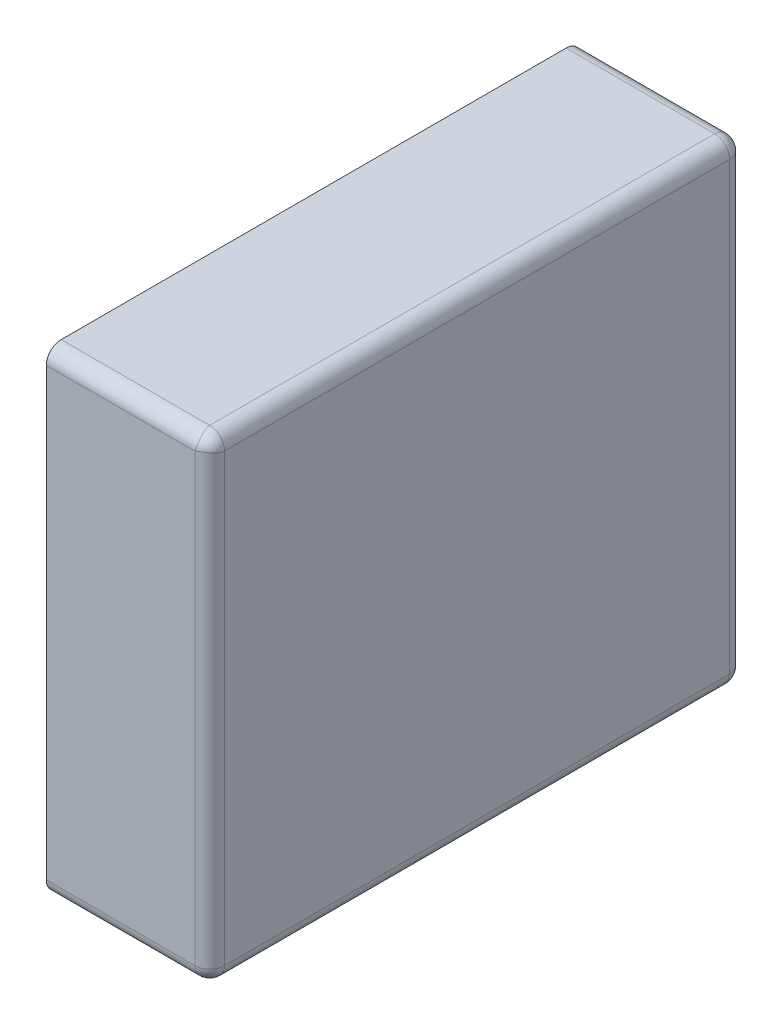
ISO-10303-21;
HEADER;
FILE_DESCRIPTION(('STEP AP214'),'2;1');
FILE_NAME('part.step','',(''),(''),'','','');
FILE_SCHEMA(('AUTOMOTIVE_DESIGN { 1 0 10303 214 1 1 1 1 }'));
ENDSEC;
DATA;
#1=APPLICATION_CONTEXT('core data for automotive mechanical design processes');
#2=APPLICATION_PROTOCOL_DEFINITION('international standard','automotive_design',2000,#1);
#3=PRODUCT_CONTEXT('',#1,'mechanical');
#4=PRODUCT('Part','Part','',(#3));
#5=PRODUCT_RELATED_PRODUCT_CATEGORY('part','',(#4));
#6=PRODUCT_DEFINITION_FORMATION('','',#4);
#7=PRODUCT_DEFINITION_CONTEXT('part definition',#1,'design');
#8=PRODUCT_DEFINITION('design','',#6,#7);
#9=PRODUCT_DEFINITION_SHAPE('','',#8);
#10=(LENGTH_UNIT() NAMED_UNIT(*) SI_UNIT(.MILLI.,.METRE.));
#11=(NAMED_UNIT(*) PLANE_ANGLE_UNIT() SI_UNIT($,.RADIAN.));
#12=(NAMED_UNIT(*) SI_UNIT($,.STERADIAN.) SOLID_ANGLE_UNIT());
#13=UNCERTAINTY_MEASURE_WITH_UNIT(LENGTH_MEASURE(1.E-05),#10,'distance_accuracy_value','');
#14=(GEOMETRIC_REPRESENTATION_CONTEXT(3) GLOBAL_UNCERTAINTY_ASSIGNED_CONTEXT((#13)) GLOBAL_UNIT_ASSIGNED_CONTEXT((#10,
#11,#12)) REPRESENTATION_CONTEXT('',''));
#15=CARTESIAN_POINT('',(0.,0.,0.));
#16=DIRECTION('',(0.,0.,1.));
#17=DIRECTION('',(1.,0.,0.));
#18=AXIS2_PLACEMENT_3D('',#15,#16,#17);
#19=CARTESIAN_POINT('',(0.25,-0.658333310554192,0.05));
#20=DIRECTION('',(-0.816496580927726,-0.408248290463864,-0.408248290463863));
#21=DIRECTION('',(0.577350269189626,-0.577350269189627,-0.577350269189625));
#22=AXIS2_PLACEMENT_3D('',#19,#20,#21);
#23=SPHERICAL_SURFACE('',#22,0.05);
#24=CARTESIAN_POINT('',(0.25,-0.658333310554192,0.05));
#25=DIRECTION('',(1.,0.,0.));
#26=DIRECTION('',(0.,0.,-1.));
#27=AXIS2_PLACEMENT_3D('',#24,#25,#26);
#28=CIRCLE('',#27,0.05);
#29=CARTESIAN_POINT('',(0.25,-0.708333310554192,0.05));
#30=VERTEX_POINT('',#29);
#31=CARTESIAN_POINT('',(0.25,-0.658333310554192,0.));
#32=VERTEX_POINT('',#31);
#33=EDGE_CURVE('E11',#30,#32,#28,.T.);
#34=ORIENTED_EDGE('',*,*,#33,.T.);
#35=CARTESIAN_POINT('',(0.25,-0.658333310554192,0.05));
#36=DIRECTION('',(0.,-1.,0.));
#37=DIRECTION('',(1.,0.,0.));
#38=AXIS2_PLACEMENT_3D('',#35,#36,#37);
#39=CIRCLE('',#38,0.05);
#40=CARTESIAN_POINT('',(0.3,-0.658333310554192,0.05));
#41=VERTEX_POINT('',#40);
#42=EDGE_CURVE('E24',#32,#41,#39,.T.);
#43=ORIENTED_EDGE('',*,*,#42,.T.);
#44=CARTESIAN_POINT('',(0.25,-0.658333310554192,0.05));
#45=DIRECTION('',(0.,0.,-1.));
#46=DIRECTION('',(0.,-1.,0.));
#47=AXIS2_PLACEMENT_3D('',#44,#45,#46);
#48=CIRCLE('',#47,0.05);
#49=EDGE_CURVE('E315',#41,#30,#48,.T.);
#50=ORIENTED_EDGE('',*,*,#49,.T.);
#51=EDGE_LOOP('',(#34,#43,#50));
#52=FACE_BOUND('',#51,.T.);
#53=ADVANCED_FACE('F17',(#52),#23,.T.);
#54=CARTESIAN_POINT('',(0.25,-0.658333310554192,1.75));
#55=DIRECTION('',(-0.408248290463863,-0.816496580927725,-0.408248290463864));
#56=DIRECTION('',(0.577350269189625,-0.577350269189627,0.577350269189626));
#57=AXIS2_PLACEMENT_3D('',#54,#55,#56);
#58=SPHERICAL_SURFACE('',#57,0.05);
#59=CARTESIAN_POINT('',(0.25,-0.658333310554192,1.8));
#60=CARTESIAN_POINT('',(0.250056476640882,-0.659164662981859,1.80000002031397));
#61=CARTESIAN_POINT('',(0.250121168311557,-0.65999542167902,1.79997917131755));
#62=CARTESIAN_POINT('',(0.250265391195623,-0.661657334802944,1.79989569556504));
#63=CARTESIAN_POINT('',(0.250344988001439,-0.66248847412573,1.79983288086806));
#64=CARTESIAN_POINT('',(0.250517234671643,-0.664148546660269,1.79966509757926));
#65=CARTESIAN_POINT('',(0.250609936033336,-0.664977457349145,1.79955995950256));
#66=CARTESIAN_POINT('',(0.250806520816706,-0.666630527199555,1.79930737239836));
#67=CARTESIAN_POINT('',(0.25091044290025,-0.667454658911413,1.79915977396341));
#68=CARTESIAN_POINT('',(0.251127528752862,-0.669095657803344,1.79882229239235));
#69=CARTESIAN_POINT('',(0.251240719867609,-0.669912494981016,1.79863228105857));
#70=CARTESIAN_POINT('',(0.251474344176626,-0.671536442570935,1.79821019528102));
#71=CARTESIAN_POINT('',(0.251594795122853,-0.672343522825329,1.79797801468437));
#72=CARTESIAN_POINT('',(0.251840892195576,-0.673945551721639,1.79747200526275));
#73=CARTESIAN_POINT('',(0.251966548375925,-0.674740472397371,1.79719809281404));
#74=CARTESIAN_POINT('',(0.252220973549075,-0.67631584408808,1.79660922840147));
#75=CARTESIAN_POINT('',(0.252349746928956,-0.677096271606362,1.79629421548598));
#76=CARTESIAN_POINT('',(0.252608300810853,-0.678640393971993,1.79562395131688));
#77=CARTESIAN_POINT('',(0.252738082163722,-0.679404071972065,1.79526866158421));
#78=CARTESIAN_POINT('',(0.252996535248399,-0.680912515415975,1.79451883535746));
#79=CARTESIAN_POINT('',(0.253125206487437,-0.681657272720296,1.79412428231988));
#80=CARTESIAN_POINT('',(0.253379323912972,-0.683125785626233,1.79329710837936));
#81=CARTESIAN_POINT('',(0.253504770480528,-0.683849543710642,1.79286449200134));
#82=CARTESIAN_POINT('',(0.253750336828149,-0.685274066953656,1.79196255359726));
#83=CARTESIAN_POINT('',(0.253870460068205,-0.685974846967864,1.79149325597784));
#84=CARTESIAN_POINT('',(0.254103304064891,-0.687351527474695,1.79051949570568));
#85=CARTESIAN_POINT('',(0.254216033516177,-0.688027456763577,1.79001507584848));
#86=CARTESIAN_POINT('',(0.254432052512975,-0.68935266005221,1.78897278428959));
#87=CARTESIAN_POINT('',(0.254535358057478,-0.690001978156978,1.78843497199004));
#88=CARTESIAN_POINT('',(0.254730542154479,-0.691272299809228,1.78732777460933));
#89=CARTESIAN_POINT('',(0.254822445957708,-0.691893363923171,1.78675846348493));
#90=CARTESIAN_POINT('',(0.254992901649071,-0.693105639944394,1.78559030584348));
#91=CARTESIAN_POINT('',(0.255071489829275,-0.693696929802492,1.78499154553938));
#92=CARTESIAN_POINT('',(0.255213463043959,-0.694848245829343,1.78376667689025));
#93=CARTESIAN_POINT('',(0.255276897009026,-0.695408368013381,1.78314066449634));
#94=CARTESIAN_POINT('',(0.255386795425953,-0.696496067335968,1.78186361983902));
#95=CARTESIAN_POINT('',(0.255433322818258,-0.697023758979868,1.78121269055809));
#96=CARTESIAN_POINT('',(0.255507737338678,-0.698045449350346,1.77988827123633));
#97=CARTESIAN_POINT('',(0.25553570253075,-0.698539581233155,1.77921488834858));
#98=CARTESIAN_POINT('',(0.255571427793508,-0.699493140439531,1.77784814127885));
#99=CARTESIAN_POINT('',(0.255579281877824,-0.699952719457549,1.77715488544524));
#100=CARTESIAN_POINT('',(0.255573335713261,-0.700836299644668,1.77575108108726));
#101=CARTESIAN_POINT('',(0.255559645939104,-0.701260470653455,1.77504063906048));
#102=CARTESIAN_POINT('',(0.255509287643763,-0.702072501389798,1.77360524818424));
#103=CARTESIAN_POINT('',(0.255472746231199,-0.702460548424196,1.77288040091383));
#104=CARTESIAN_POINT('',(0.255375493621831,-0.703199738480209,1.77141907045753));
#105=CARTESIAN_POINT('',(0.255314925981526,-0.70355108531067,1.77068268089524));
#106=CARTESIAN_POINT('',(0.255168570932992,-0.704216423264989,1.76920120834795));
#107=CARTESIAN_POINT('',(0.255082942970717,-0.704530633447628,1.76845620808787));
#108=CARTESIAN_POINT('',(0.254885566112575,-0.705121386709123,1.76696051703845));
#109=CARTESIAN_POINT('',(0.254773991607376,-0.705398162565069,1.76620989527186));
#110=CARTESIAN_POINT('',(0.254523973299393,-0.705913876381134,1.76470600292695));
#111=CARTESIAN_POINT('',(0.254385717519098,-0.706153059023342,1.7639527851382));
#112=CARTESIAN_POINT('',(0.254081755398417,-0.706593549745939,1.76244679638543));
#113=CARTESIAN_POINT('',(0.253916248962334,-0.706795112374401,1.76169405953744));
#114=CARTESIAN_POINT('',(0.253557343726359,-0.707160476248509,1.76019206042752));
#115=CARTESIAN_POINT('',(0.253364154831346,-0.707324539502695,1.75944281229227));
#116=CARTESIAN_POINT('',(0.253052732369609,-0.707542869289562,1.7583219455075));
#117=CARTESIAN_POINT('',(0.252945638881777,-0.707610870709135,1.75794983260432));
#118=CARTESIAN_POINT('',(0.252724431166697,-0.707737569445092,1.75720763742837));
#119=CARTESIAN_POINT('',(0.252610344441124,-0.707796300321971,1.75683755274195));
#120=CARTESIAN_POINT('',(0.252375149481327,-0.70790450391496,1.75609981269566));
#121=CARTESIAN_POINT('',(0.252254068989278,-0.707954010307306,1.75573215342186));
#122=CARTESIAN_POINT('',(0.252004892004011,-0.708043823540288,1.75499964182244));
#123=CARTESIAN_POINT('',(0.251876823418455,-0.708084164066007,1.75463478414168));
#124=CARTESIAN_POINT('',(0.25161368768569,-0.708155710450416,1.7539082563057));
#125=CARTESIAN_POINT('',(0.251478648512781,-0.708186949917715,1.75354657933213));
#126=CARTESIAN_POINT('',(0.251201599789781,-0.708240367053443,1.75282678964261));
#127=CARTESIAN_POINT('',(0.251059618183824,-0.708262578160602,1.75246866865684));
#128=CARTESIAN_POINT('',(0.250768722771826,-0.708298018075102,1.75175636445159));
#129=CARTESIAN_POINT('',(0.250619836783965,-0.70831128006162,1.75140217152902));
#130=CARTESIAN_POINT('',(0.250315184973883,-0.70832891062971,1.75069809533217));
#131=CARTESIAN_POINT('',(0.25015944673132,-0.708333312030094,1.75034820094293));
#132=CARTESIAN_POINT('',(0.25,-0.708333310554192,1.75));
#133=B_SPLINE_CURVE_WITH_KNOTS('',3,(#59,#60,#61,#62,#63,#64,#65,#66,#67,#68,#69,#70,#71,#72,
#73,#74,#75,#76,#77,#78,#79,#80,#81,#82,#83,#84,#85,#86,#87,#88,#89,#90,#91,#92,#93,#94,#95,#96,
#97,#98,#99,#100,#101,#102,#103,#104,#105,#106,#107,#108,#109,#110,#111,#112,#113,#114,#115,
#116,#117,#118,#119,#120,#121,#122,#123,#124,#125,#126,#127,#128,#129,#130,#131,#132),
.UNSPECIFIED.,.F.,.F.,(4,2,2,2,2,2,2,2,2,2,2,2,2,2,2,2,2,2,2,2,2,2,2,2,2,2,2,2,2,2,2,2,2,2,2,2,
4),(0.,0.00249945349828864,0.00501017636236172,0.00753105510997415,0.0100609150362242,
0.0125985278601288,0.0151426194708621,0.017691877752768,0.020244960471291,0.0228005032044077,
0.0253571273060391,0.0279134478892868,0.030468081818201,0.0330196556971654,0.0355668138468769,
0.0381082262553105,0.0406425964909795,0.0431686695642027,0.0456852397199664,0.048191158143267,
0.0506853405545279,0.0531667746687544,0.0556345274875088,0.0580877523875283,0.0605256959638786,
0.0629477045789642,0.0653532305615734,0.0677418379925142,0.0701132080055176,0.0712924926926686,
0.0724674051483095,0.0736379404537152,0.0748041017706803,0.0759659004268235,0.077123355986903,
0.0782764963093342,0.0794253575870824),.UNSPECIFIED.);
#134=CARTESIAN_POINT('',(0.25,-0.658333310554192,1.8));
#135=VERTEX_POINT('',#134);
#136=CARTESIAN_POINT('',(0.25,-0.708333310554192,1.75));
#137=VERTEX_POINT('',#136);
#138=EDGE_CURVE('E267',#135,#137,#133,.T.);
#139=ORIENTED_EDGE('',*,*,#138,.T.);
#140=CARTESIAN_POINT('',(0.25,-0.658333310554192,1.75));
#141=DIRECTION('',(0.,0.,1.));
#142=DIRECTION('',(1.,0.,0.));
#143=AXIS2_PLACEMENT_3D('',#140,#141,#142);
#144=CIRCLE('',#143,0.05);
#145=CARTESIAN_POINT('',(0.3,-0.658333310554192,1.75));
#146=VERTEX_POINT('',#145);
#147=EDGE_CURVE('E263',#137,#146,#144,.T.);
#148=ORIENTED_EDGE('',*,*,#147,.T.);
#149=CARTESIAN_POINT('',(0.25,-0.658333310554192,1.75));
#150=DIRECTION('',(0.,-1.,0.));
#151=DIRECTION('',(0.,0.,1.));
#152=AXIS2_PLACEMENT_3D('',#149,#150,#151);
#153=CIRCLE('',#152,0.05);
#154=EDGE_CURVE('E258',#146,#135,#153,.T.);
#155=ORIENTED_EDGE('',*,*,#154,.T.);
#156=EDGE_LOOP('',(#139,#148,#155));
#157=FACE_BOUND('',#156,.T.);
#158=ADVANCED_FACE('F292',(#157),#58,.T.);
#159=CARTESIAN_POINT('',(0.25,-0.658333310554192,0.));
#160=DIRECTION('',(0.,0.,1.));
#161=DIRECTION('',(0.707106781186548,-0.707106781186548,0.));
#162=AXIS2_PLACEMENT_3D('',#159,#160,#161);
#163=CYLINDRICAL_SURFACE('',#162,0.05);
#164=ORIENTED_EDGE('',*,*,#147,.F.);
#165=DIRECTION('',(0.,0.,-1.));
#166=VECTOR('',#165,1.);
#167=CARTESIAN_POINT('',(0.25,-0.708333310554192,0.));
#168=LINE('',#167,#166);
#169=EDGE_CURVE('E253',#137,#30,#168,.T.);
#170=ORIENTED_EDGE('',*,*,#169,.T.);
#171=ORIENTED_EDGE('',*,*,#49,.F.);
#172=DIRECTION('',(0.,0.,1.));
#173=VECTOR('',#172,1.);
#174=CARTESIAN_POINT('',(0.3,-0.658333310554192,0.));
#175=LINE('',#174,#173);
#176=EDGE_CURVE('E250',#41,#146,#175,.T.);
#177=ORIENTED_EDGE('',*,*,#176,.T.);
#178=EDGE_LOOP('',(#164,#170,#171,#177));
#179=FACE_BOUND('',#178,.T.);
#180=ADVANCED_FACE('F296',(#179),#163,.T.);
#181=CARTESIAN_POINT('',(0.25,0.841666689445808,0.05));
#182=DIRECTION('',(-0.408248290463862,-0.408248290463864,-0.816496580927726));
#183=DIRECTION('',(0.577350269189626,0.577350269189626,-0.577350269189626));
#184=AXIS2_PLACEMENT_3D('',#181,#182,#183);
#185=SPHERICAL_SURFACE('',#184,0.05);
#186=CARTESIAN_POINT('',(0.25,0.841666689445808,0.05));
#187=DIRECTION('',(0.,1.,0.));
#188=DIRECTION('',(0.,0.,-1.));
#189=AXIS2_PLACEMENT_3D('',#186,#187,#188);
#190=CIRCLE('',#189,0.05);
#191=CARTESIAN_POINT('',(0.3,0.841666689445808,0.05));
#192=VERTEX_POINT('',#191);
#193=CARTESIAN_POINT('',(0.25,0.841666689445808,0.));
#194=VERTEX_POINT('',#193);
#195=EDGE_CURVE('E248',#192,#194,#190,.T.);
#196=ORIENTED_EDGE('',*,*,#195,.T.);
#197=CARTESIAN_POINT('',(0.25,0.841666689445808,0.05));
#198=DIRECTION('',(1.,0.,0.));
#199=DIRECTION('',(0.,1.,0.));
#200=AXIS2_PLACEMENT_3D('',#197,#198,#199);
#201=CIRCLE('',#200,0.05);
#202=CARTESIAN_POINT('',(0.25,0.891666689445808,0.05));
#203=VERTEX_POINT('',#202);
#204=EDGE_CURVE('E246',#194,#203,#201,.T.);
#205=ORIENTED_EDGE('',*,*,#204,.T.);
#206=CARTESIAN_POINT('',(0.25,0.841666689445808,0.05));
#207=DIRECTION('',(0.,0.,-1.));
#208=DIRECTION('',(1.,0.,0.));
#209=AXIS2_PLACEMENT_3D('',#206,#207,#208);
#210=CIRCLE('',#209,0.05);
#211=EDGE_CURVE('E243',#203,#192,#210,.T.);
#212=ORIENTED_EDGE('',*,*,#211,.T.);
#213=EDGE_LOOP('',(#196,#205,#212));
#214=FACE_BOUND('',#213,.T.);
#215=ADVANCED_FACE('F301',(#214),#185,.T.);
#216=CARTESIAN_POINT('',(0.1625,0.841666689445808,0.05));
#217=DIRECTION('',(1.,0.,0.));
#218=DIRECTION('',(0.,0.707106781186548,-0.707106781186547));
#219=AXIS2_PLACEMENT_3D('',#216,#217,#218);
#220=CYLINDRICAL_SURFACE('',#219,0.05);
#221=CARTESIAN_POINT('',(-0.25,0.841666689445808,0.05));
#222=DIRECTION('',(1.,0.,0.));
#223=DIRECTION('',(0.,0.707106781186548,-0.707106781186547));
#224=AXIS2_PLACEMENT_3D('',#221,#222,#223);
#225=CIRCLE('',#224,0.05);
#226=CARTESIAN_POINT('',(-0.25,0.841666689445808,0.));
#227=VERTEX_POINT('',#226);
#228=CARTESIAN_POINT('',(-0.25,0.891666689445808,0.05));
#229=VERTEX_POINT('',#228);
#230=EDGE_CURVE('E239',#227,#229,#225,.T.);
#231=ORIENTED_EDGE('',*,*,#230,.T.);
#232=DIRECTION('',(1.,0.,0.));
#233=VECTOR('',#232,1.);
#234=CARTESIAN_POINT('',(0.1625,0.891666689445808,0.05));
#235=LINE('',#234,#233);
#236=EDGE_CURVE('E233',#229,#203,#235,.T.);
#237=ORIENTED_EDGE('',*,*,#236,.T.);
#238=ORIENTED_EDGE('',*,*,#204,.F.);
#239=DIRECTION('',(-1.,0.,0.));
#240=VECTOR('',#239,1.);
#241=CARTESIAN_POINT('',(0.1625,0.841666689445808,0.));
#242=LINE('',#241,#240);
#243=EDGE_CURVE('E231',#194,#227,#242,.T.);
#244=ORIENTED_EDGE('',*,*,#243,.T.);
#245=EDGE_LOOP('',(#231,#237,#238,#244));
#246=FACE_BOUND('',#245,.T.);
#247=ADVANCED_FACE('F194',(#246),#220,.T.);
#248=CARTESIAN_POINT('',(0.25,0.841666689445808,1.75));
#249=DIRECTION('',(0.408248290463863,0.408248290463863,-0.816496580927726));
#250=DIRECTION('',(0.577350269189625,0.577350269189626,0.577350269189626));
#251=AXIS2_PLACEMENT_3D('',#248,#249,#250);
#252=SPHERICAL_SURFACE('',#251,0.05);
#253=CARTESIAN_POINT('',(0.25,0.841666689445808,1.8));
#254=CARTESIAN_POINT('',(0.250348200942932,0.841826136177128,1.8000000014759));
#255=CARTESIAN_POINT('',(0.250698095332166,0.841981874419691,1.79999560007552));
#256=CARTESIAN_POINT('',(0.251402171529021,0.842286526229773,1.79997796950743));
#257=CARTESIAN_POINT('',(0.251756364451594,0.842435412217634,1.79996470752091));
#258=CARTESIAN_POINT('',(0.252468668656838,0.842726307629632,1.79992926760641));
#259=CARTESIAN_POINT('',(0.25282678964261,0.842868289235589,1.79990705649925));
#260=CARTESIAN_POINT('',(0.253546579332125,0.843145337958589,1.79985363936352));
#261=CARTESIAN_POINT('',(0.253908256305697,0.843280377131498,1.79982239989622));
#262=CARTESIAN_POINT('',(0.254634784141684,0.843543512864263,1.79975085351182));
#263=CARTESIAN_POINT('',(0.254999641822439,0.843671581449819,1.7997105129861));
#264=CARTESIAN_POINT('',(0.255732153421865,0.843920758435086,1.79962069975311));
#265=CARTESIAN_POINT('',(0.256099812695661,0.844041838927135,1.79957119336077));
#266=CARTESIAN_POINT('',(0.256837552741953,0.844277033886932,1.79946298976778));
#267=CARTESIAN_POINT('',(0.257207637428366,0.844391120612505,1.7994042588909));
#268=CARTESIAN_POINT('',(0.257949832604319,0.844612328327585,1.79927756015494));
#269=CARTESIAN_POINT('',(0.258321945507501,0.844719421815417,1.79920955873537));
#270=CARTESIAN_POINT('',(0.259442812292273,0.845030844277154,1.7989912289485));
#271=CARTESIAN_POINT('',(0.260192060427522,0.845224033172167,1.79882716569432));
#272=CARTESIAN_POINT('',(0.261694059537444,0.845582938408142,1.79846180182021));
#273=CARTESIAN_POINT('',(0.262446796385434,0.845748444844225,1.79826023919175));
#274=CARTESIAN_POINT('',(0.263952785138195,0.846052406964906,1.79781974846915));
#275=CARTESIAN_POINT('',(0.264706002926951,0.846190662745201,1.79758056582694));
#276=CARTESIAN_POINT('',(0.266209895271862,0.846440681053184,1.79706485201088));
#277=CARTESIAN_POINT('',(0.266960517038454,0.846552255558383,1.79678807615493));
#278=CARTESIAN_POINT('',(0.268456208087868,0.846749632416525,1.79619732289344));
#279=CARTESIAN_POINT('',(0.269201208347948,0.8468352603788,1.7958831127108));
#280=CARTESIAN_POINT('',(0.270682680895238,0.846981615427333,1.79521777475648));
#281=CARTESIAN_POINT('',(0.271419070457526,0.847042183067639,1.79486642792602));
#282=CARTESIAN_POINT('',(0.272880400913832,0.847139435677007,1.79412723787));
#283=CARTESIAN_POINT('',(0.273605248184243,0.847175977089571,1.79373919083561));
#284=CARTESIAN_POINT('',(0.275040639060477,0.847226335384912,1.79292716009926));
#285=CARTESIAN_POINT('',(0.275751081087255,0.847240025159069,1.79250298909048));
#286=CARTESIAN_POINT('',(0.277154885445235,0.847245971323632,1.79161940890336));
#287=CARTESIAN_POINT('',(0.277848141278855,0.847238117239316,1.79115982988534));
#288=CARTESIAN_POINT('',(0.279214888348585,0.847202391976558,1.79020627067896));
#289=CARTESIAN_POINT('',(0.279888271236327,0.847174426784487,1.78971213879615));
#290=CARTESIAN_POINT('',(0.281212690558093,0.847100012264066,1.78869044842568));
#291=CARTESIAN_POINT('',(0.281863619839021,0.847053484871761,1.78816275678178));
#292=CARTESIAN_POINT('',(0.283140664496341,0.846943586454834,1.78707505745919));
#293=CARTESIAN_POINT('',(0.283766676890247,0.846880152489767,1.78651493527515));
#294=CARTESIAN_POINT('',(0.28499154553938,0.846738179275083,1.7853636192483));
#295=CARTESIAN_POINT('',(0.285590305843476,0.846659591094879,1.7847723293902));
#296=CARTESIAN_POINT('',(0.286758463484926,0.846489135403516,1.78356005336898));
#297=CARTESIAN_POINT('',(0.287327774609329,0.846397231600287,1.78293898925504));
#298=CARTESIAN_POINT('',(0.288434971990044,0.846202047503286,1.78166866760279));
#299=CARTESIAN_POINT('',(0.288972784289588,0.846098741958783,1.78101934949802));
#300=CARTESIAN_POINT('',(0.290015075848481,0.845882722961985,1.77969414620939));
#301=CARTESIAN_POINT('',(0.290519495705679,0.845769993510699,1.7790182169205));
#302=CARTESIAN_POINT('',(0.291493255977843,0.845537149514013,1.77764153641367));
#303=CARTESIAN_POINT('',(0.291962553597264,0.845417026273957,1.77694075639946));
#304=CARTESIAN_POINT('',(0.292864492001337,0.845171459926336,1.77551623315645));
#305=CARTESIAN_POINT('',(0.293297108379355,0.84504601335878,1.77479247507204));
#306=CARTESIAN_POINT('',(0.294124282319878,0.844791895933245,1.7733239621661));
#307=CARTESIAN_POINT('',(0.294518835357465,0.844663224694207,1.77257920486178));
#308=CARTESIAN_POINT('',(0.295268661584212,0.84440477160953,1.77107076141787));
#309=CARTESIAN_POINT('',(0.29562395131688,0.844274990256661,1.7703070834178));
#310=CARTESIAN_POINT('',(0.29629421548598,0.844016436374764,1.76876296105217));
#311=CARTESIAN_POINT('',(0.296609228401466,0.843887662994883,1.76798253353389));
#312=CARTESIAN_POINT('',(0.297198092814036,0.843633237821733,1.76640716184318));
#313=CARTESIAN_POINT('',(0.297472005262752,0.843507581641384,1.76561224116745));
#314=CARTESIAN_POINT('',(0.297978014684369,0.843261484568661,1.76401021227114));
#315=CARTESIAN_POINT('',(0.298210195281024,0.843141033622434,1.76320313201674));
#316=CARTESIAN_POINT('',(0.298632281058567,0.842907409313417,1.76157918442682));
#317=CARTESIAN_POINT('',(0.298822292392348,0.84279421819867,1.76076234724915));
#318=CARTESIAN_POINT('',(0.299159773963409,0.842577132346058,1.75912134835722));
#319=CARTESIAN_POINT('',(0.299307372398355,0.842473210262514,1.75829721664536));
#320=CARTESIAN_POINT('',(0.299559959502557,0.842276625479144,1.75664414679495));
#321=CARTESIAN_POINT('',(0.299665097579262,0.842183924117451,1.75581523610608));
#322=CARTESIAN_POINT('',(0.299832880868058,0.842011677447247,1.75415516357154));
#323=CARTESIAN_POINT('',(0.299895695565037,0.841932080641431,1.75332402424875));
#324=CARTESIAN_POINT('',(0.299979171317549,0.841787857757365,1.75166211112483));
#325=CARTESIAN_POINT('',(0.300000020313967,0.84172316608669,1.75083135242767));
#326=CARTESIAN_POINT('',(0.3,0.841666689445808,1.75));
#327=B_SPLINE_CURVE_WITH_KNOTS('',3,(#253,#254,#255,#256,#257,#258,#259,#260,#261,#262,#263,
#264,#265,#266,#267,#268,#269,#270,#271,#272,#273,#274,#275,#276,#277,#278,#279,#280,#281,#282,
#283,#284,#285,#286,#287,#288,#289,#290,#291,#292,#293,#294,#295,#296,#297,#298,#299,#300,#301,
#302,#303,#304,#305,#306,#307,#308,#309,#310,#311,#312,#313,#314,#315,#316,#317,#318,#319,#320,
#321,#322,#323,#324,#325,#326),.UNSPECIFIED.,.F.,.F.,(4,2,2,2,2,2,2,2,2,2,2,2,2,2,2,2,2,2,2,2,2,
2,2,2,2,2,2,2,2,2,2,2,2,2,2,2,4),(0.,0.00114886127774815,0.00230200160017932,
0.00345945716025889,0.00462125581640195,0.00578741713336713,0.00695795243877275,
0.00813286489441384,0.00931214958156472,0.0116835195945681,0.014072127025509,0.0164776530081181,
0.0188996616232038,0.0213376051995539,0.0237908300995735,0.026258582918328,0.0287400170325544,
0.0312341994438154,0.033740117867116,0.0362566880228797,0.0387827610961028,0.0413171313317719,
0.0438585437402054,0.0464057018899169,0.0489572757688814,0.0515119096977955,0.0540682302810433,
0.0566248543826747,0.0591803971157913,0.0617334798343144,0.0642827381162203,0.0668268297269534,
0.0693644425508581,0.071894302477108,0.0744151812247205,0.0769259040887937,0.0794253575870821),.UNSPECIFIED.);
#328=CARTESIAN_POINT('',(0.25,0.841666689445808,1.8));
#329=VERTEX_POINT('',#328);
#330=CARTESIAN_POINT('',(0.3,0.841666689445808,1.75));
#331=VERTEX_POINT('',#330);
#332=EDGE_CURVE('E217',#329,#331,#327,.T.);
#333=ORIENTED_EDGE('',*,*,#332,.T.);
#334=CARTESIAN_POINT('',(0.25,0.841666689445808,1.75));
#335=DIRECTION('',(0.,0.,1.));
#336=DIRECTION('',(0.,1.,0.));
#337=AXIS2_PLACEMENT_3D('',#334,#335,#336);
#338=CIRCLE('',#337,0.05);
#339=CARTESIAN_POINT('',(0.25,0.891666689445808,1.75));
#340=VERTEX_POINT('',#339);
#341=EDGE_CURVE('E215',#331,#340,#338,.T.);
#342=ORIENTED_EDGE('',*,*,#341,.T.);
#343=CARTESIAN_POINT('',(0.25,0.891666689445808,1.75));
#344=CARTESIAN_POINT('',(0.250056476640882,0.891666709759775,1.75083135242767));
#345=CARTESIAN_POINT('',(0.250121168311557,0.891645860763357,1.75166211112483));
#346=CARTESIAN_POINT('',(0.250265391195623,0.891562385010845,1.75332402424875));
#347=CARTESIAN_POINT('',(0.250344988001439,0.891499570313866,1.75415516357154));
#348=CARTESIAN_POINT('',(0.250517234671643,0.89133178702507,1.75581523610608));
#349=CARTESIAN_POINT('',(0.250609936033336,0.891226648948365,1.75664414679495));
#350=CARTESIAN_POINT('',(0.250806520816706,0.890974061844164,1.75829721664536));
#351=CARTESIAN_POINT('',(0.25091044290025,0.890826463409217,1.75912134835722));
#352=CARTESIAN_POINT('',(0.251127528752862,0.890488981838156,1.76076234724915));
#353=CARTESIAN_POINT('',(0.251240719867609,0.890298970504375,1.76157918442682));
#354=CARTESIAN_POINT('',(0.251474344176626,0.889876884726832,1.76320313201674));
#355=CARTESIAN_POINT('',(0.251594795122853,0.889644704130177,1.76401021227114));
#356=CARTESIAN_POINT('',(0.251840892195576,0.88913869470856,1.76561224116745));
#357=CARTESIAN_POINT('',(0.251966548375925,0.888864782259843,1.76640716184318));
#358=CARTESIAN_POINT('',(0.252220973549075,0.888275917847274,1.76798253353389));
#359=CARTESIAN_POINT('',(0.252349746928956,0.887960904931788,1.76876296105217));
#360=CARTESIAN_POINT('',(0.252608300810853,0.887290640762688,1.7703070834178));
#361=CARTESIAN_POINT('',(0.252738082163722,0.88693535103002,1.77107076141787));
#362=CARTESIAN_POINT('',(0.252996535248399,0.886185524803273,1.77257920486178));
#363=CARTESIAN_POINT('',(0.253125206487437,0.885790971765686,1.7733239621661));
#364=CARTESIAN_POINT('',(0.253379323912972,0.884963797825163,1.77479247507204));
#365=CARTESIAN_POINT('',(0.253504770480528,0.884531181447145,1.77551623315645));
#366=CARTESIAN_POINT('',(0.253750336828149,0.883629243043072,1.77694075639946));
#367=CARTESIAN_POINT('',(0.253870460068205,0.883159945423651,1.77764153641367));
#368=CARTESIAN_POINT('',(0.254103304064891,0.882186185151487,1.7790182169205));
#369=CARTESIAN_POINT('',(0.254216033516177,0.881681765294289,1.77969414620939));
#370=CARTESIAN_POINT('',(0.254432052512975,0.880639473735396,1.78101934949802));
#371=CARTESIAN_POINT('',(0.254535358057478,0.880101661435852,1.78166866760279));
#372=CARTESIAN_POINT('',(0.254730542154479,0.878994464055137,1.78293898925504));
#373=CARTESIAN_POINT('',(0.254822445957708,0.878425152930734,1.78356005336898));
#374=CARTESIAN_POINT('',(0.254992901649071,0.877256995289284,1.7847723293902));
#375=CARTESIAN_POINT('',(0.255071489829275,0.876658234985188,1.7853636192483));
#376=CARTESIAN_POINT('',(0.255213463043959,0.875433366336055,1.78651493527515));
#377=CARTESIAN_POINT('',(0.255276897009026,0.874807353942149,1.78707505745919));
#378=CARTESIAN_POINT('',(0.255386795425953,0.873530309284829,1.78816275678178));
#379=CARTESIAN_POINT('',(0.255433322818258,0.872879380003901,1.78869044842568));
#380=CARTESIAN_POINT('',(0.255507737338678,0.871554960682135,1.78971213879615));
#381=CARTESIAN_POINT('',(0.25553570253075,0.870881577794393,1.79020627067896));
#382=CARTESIAN_POINT('',(0.255571427793508,0.869514830724663,1.79115982988534));
#383=CARTESIAN_POINT('',(0.255579281877824,0.868821574891043,1.79161940890336));
#384=CARTESIAN_POINT('',(0.255573335713261,0.867417770533063,1.79250298909048));
#385=CARTESIAN_POINT('',(0.255559645939104,0.866707328506285,1.79292716009926));
#386=CARTESIAN_POINT('',(0.255509287643763,0.865271937630051,1.79373919083561));
#387=CARTESIAN_POINT('',(0.255472746231199,0.86454709035964,1.79412723787));
#388=CARTESIAN_POINT('',(0.255375493621831,0.863085759903334,1.79486642792602));
#389=CARTESIAN_POINT('',(0.255314925981526,0.862349370341046,1.79521777475648));
#390=CARTESIAN_POINT('',(0.255168570932992,0.860867897793755,1.7958831127108));
#391=CARTESIAN_POINT('',(0.255082942970717,0.860122897533676,1.79619732289344));
#392=CARTESIAN_POINT('',(0.254885566112575,0.858627206484262,1.79678807615493));
#393=CARTESIAN_POINT('',(0.254773991607376,0.85787658471767,1.79706485201088));
#394=CARTESIAN_POINT('',(0.254523973299393,0.856372692372759,1.79758056582694));
#395=CARTESIAN_POINT('',(0.254385717519098,0.855619474584003,1.79781974846915));
#396=CARTESIAN_POINT('',(0.254081755398417,0.854113485831242,1.79826023919175));
#397=CARTESIAN_POINT('',(0.253916248962334,0.853360748983252,1.79846180182021));
#398=CARTESIAN_POINT('',(0.253557343726359,0.85185874987333,1.79882716569432));
#399=CARTESIAN_POINT('',(0.253364154831346,0.851109501738081,1.7989912289485));
#400=CARTESIAN_POINT('',(0.253052732369609,0.849988634953309,1.79920955873537));
#401=CARTESIAN_POINT('',(0.252945638881777,0.849616522050127,1.79927756015494));
#402=CARTESIAN_POINT('',(0.252724431166697,0.848874326874174,1.7994042588909));
#403=CARTESIAN_POINT('',(0.252610344441124,0.848504242187761,1.79946298976778));
#404=CARTESIAN_POINT('',(0.252375149481327,0.847766502141469,1.79957119336077));
#405=CARTESIAN_POINT('',(0.252254068989278,0.847398842867673,1.79962069975311));
#406=CARTESIAN_POINT('',(0.252004892004011,0.846666331268247,1.7997105129861));
#407=CARTESIAN_POINT('',(0.251876823418455,0.846301473587492,1.79975085351182));
#408=CARTESIAN_POINT('',(0.25161368768569,0.845574945751505,1.79982239989622));
#409=CARTESIAN_POINT('',(0.251478648512781,0.845213268777933,1.79985363936352));
#410=CARTESIAN_POINT('',(0.251201599789781,0.844493479088418,1.79990705649925));
#411=CARTESIAN_POINT('',(0.251059618183824,0.844135358102647,1.79992926760641));
#412=CARTESIAN_POINT('',(0.250768722771826,0.843423053897402,1.79996470752091));
#413=CARTESIAN_POINT('',(0.250619836783965,0.843068860974829,1.79997796950743));
#414=CARTESIAN_POINT('',(0.250315184973883,0.842364784777974,1.79999560007552));
#415=CARTESIAN_POINT('',(0.25015944673132,0.84201489038874,1.8000000014759));
#416=CARTESIAN_POINT('',(0.25,0.841666689445808,1.8));
#417=B_SPLINE_CURVE_WITH_KNOTS('',3,(#343,#344,#345,#346,#347,#348,#349,#350,#351,#352,#353,
#354,#355,#356,#357,#358,#359,#360,#361,#362,#363,#364,#365,#366,#367,#368,#369,#370,#371,#372,
#373,#374,#375,#376,#377,#378,#379,#380,#381,#382,#383,#384,#385,#386,#387,#388,#389,#390,#391,
#392,#393,#394,#395,#396,#397,#398,#399,#400,#401,#402,#403,#404,#405,#406,#407,#408,#409,#410,
#411,#412,#413,#414,#415,#416),.UNSPECIFIED.,.F.,.F.,(4,2,2,2,2,2,2,2,2,2,2,2,2,2,2,2,2,2,2,2,2,
2,2,2,2,2,2,2,2,2,2,2,2,2,2,2,4),(0.,0.00249945349828864,0.00501017636236185,
0.00753105510997417,0.0100609150362242,0.0125985278601289,0.0151426194708621,0.017691877752768,
0.0202449604712911,0.0228005032044077,0.0253571273060391,0.0279134478892866,0.0304680818182009,
0.0330196556971655,0.0355668138468769,0.0381082262553107,0.0406425964909796,0.0431686695642027,
0.0456852397199663,0.048191158143267,0.0506853405545278,0.0531667746687543,0.0556345274875087,
0.0580877523875283,0.0605256959638785,0.0629477045789642,0.0653532305615734,0.0677418379925142,
0.0701132080055176,0.0712924926926684,0.0724674051483094,0.0736379404537151,0.0748041017706803,
0.0759659004268233,0.0771233559869029,0.0782764963093342,0.0794253575870822),.UNSPECIFIED.);
#418=EDGE_CURVE('E165',#340,#329,#417,.T.);
#419=ORIENTED_EDGE('',*,*,#418,.T.);
#420=EDGE_LOOP('',(#333,#342,#419));
#421=FACE_BOUND('',#420,.T.);
#422=ADVANCED_FACE('F189',(#421),#252,.T.);
#423=CARTESIAN_POINT('',(0.25,0.841666689445808,0.));
#424=DIRECTION('',(0.,0.,1.));
#425=DIRECTION('',(0.707106781186548,0.707106781186548,0.));
#426=AXIS2_PLACEMENT_3D('',#423,#424,#425);
#427=CYLINDRICAL_SURFACE('',#426,0.05);
#428=ORIENTED_EDGE('',*,*,#341,.F.);
#429=DIRECTION('',(0.,0.,-1.));
#430=VECTOR('',#429,1.);
#431=CARTESIAN_POINT('',(0.3,0.841666689445808,0.));
#432=LINE('',#431,#430);
#433=EDGE_CURVE('E160',#331,#192,#432,.T.);
#434=ORIENTED_EDGE('',*,*,#433,.T.);
#435=ORIENTED_EDGE('',*,*,#211,.F.);
#436=DIRECTION('',(0.,0.,1.));
#437=VECTOR('',#436,1.);
#438=CARTESIAN_POINT('',(0.25,0.891666689445808,0.));
#439=LINE('',#438,#437);
#440=EDGE_CURVE('E155',#203,#340,#439,.T.);
#441=ORIENTED_EDGE('',*,*,#440,.T.);
#442=EDGE_LOOP('',(#428,#434,#435,#441));
#443=FACE_BOUND('',#442,.T.);
#444=ADVANCED_FACE('F183',(#443),#427,.T.);
#445=CARTESIAN_POINT('',(0.1625,0.841666689445808,1.75));
#446=DIRECTION('',(-1.,0.,0.));
#447=DIRECTION('',(0.,0.707106781186548,0.707106781186548));
#448=AXIS2_PLACEMENT_3D('',#445,#446,#447);
#449=CYLINDRICAL_SURFACE('',#448,0.05);
#450=CARTESIAN_POINT('',(-0.25,0.841666689445808,1.75));
#451=DIRECTION('',(1.,0.,0.));
#452=DIRECTION('',(0.,0.707106781186548,0.707106781186548));
#453=AXIS2_PLACEMENT_3D('',#450,#451,#452);
#454=CIRCLE('',#453,0.05);
#455=CARTESIAN_POINT('',(-0.25,0.891666689445808,1.75));
#456=VERTEX_POINT('',#455);
#457=CARTESIAN_POINT('',(-0.25,0.841666689445808,1.8));
#458=VERTEX_POINT('',#457);
#459=EDGE_CURVE('E153',#456,#458,#454,.T.);
#460=ORIENTED_EDGE('',*,*,#459,.T.);
#461=DIRECTION('',(1.,0.,0.));
#462=VECTOR('',#461,1.);
#463=CARTESIAN_POINT('',(0.1625,0.841666689445808,1.8));
#464=LINE('',#463,#462);
#465=EDGE_CURVE('E148',#458,#329,#464,.T.);
#466=ORIENTED_EDGE('',*,*,#465,.T.);
#467=ORIENTED_EDGE('',*,*,#418,.F.);
#468=DIRECTION('',(-1.,0.,0.));
#469=VECTOR('',#468,1.);
#470=CARTESIAN_POINT('',(0.1625,0.891666689445808,1.75));
#471=LINE('',#470,#469);
#472=EDGE_CURVE('E143',#340,#456,#471,.T.);
#473=ORIENTED_EDGE('',*,*,#472,.T.);
#474=EDGE_LOOP('',(#460,#466,#467,#473));
#475=FACE_BOUND('',#474,.T.);
#476=ADVANCED_FACE('F172',(#475),#449,.T.);
#477=CARTESIAN_POINT('',(0.25,-0.308333310554192,1.75));
#478=DIRECTION('',(0.,1.,0.));
#479=DIRECTION('',(0.707106781186548,0.,0.707106781186548));
#480=AXIS2_PLACEMENT_3D('',#477,#478,#479);
#481=CYLINDRICAL_SURFACE('',#480,0.05);
#482=ORIENTED_EDGE('',*,*,#332,.F.);
#483=DIRECTION('',(0.,-1.,0.));
#484=VECTOR('',#483,1.);
#485=CARTESIAN_POINT('',(0.25,-0.308333310554192,1.8));
#486=LINE('',#485,#484);
#487=EDGE_CURVE('E138',#329,#135,#486,.T.);
#488=ORIENTED_EDGE('',*,*,#487,.T.);
#489=ORIENTED_EDGE('',*,*,#154,.F.);
#490=DIRECTION('',(0.,1.,0.));
#491=VECTOR('',#490,1.);
#492=CARTESIAN_POINT('',(0.3,-0.308333310554192,1.75));
#493=LINE('',#492,#491);
#494=EDGE_CURVE('E133',#146,#331,#493,.T.);
#495=ORIENTED_EDGE('',*,*,#494,.T.);
#496=EDGE_LOOP('',(#482,#488,#489,#495));
#497=FACE_BOUND('',#496,.T.);
#498=ADVANCED_FACE('F182',(#497),#481,.T.);
#499=CARTESIAN_POINT('',(0.25,-0.308333310554192,0.05));
#500=DIRECTION('',(0.,-1.,0.));
#501=DIRECTION('',(0.707106781186548,0.,-0.707106781186547));
#502=AXIS2_PLACEMENT_3D('',#499,#500,#501);
#503=CYLINDRICAL_SURFACE('',#502,0.05);
#504=ORIENTED_EDGE('',*,*,#42,.F.);
#505=DIRECTION('',(0.,1.,0.));
#506=VECTOR('',#505,1.);
#507=CARTESIAN_POINT('',(0.25,-0.308333310554192,0.));
#508=LINE('',#507,#506);
#509=EDGE_CURVE('E130',#32,#194,#508,.T.);
#510=ORIENTED_EDGE('',*,*,#509,.T.);
#511=ORIENTED_EDGE('',*,*,#195,.F.);
#512=DIRECTION('',(0.,-1.,0.));
#513=VECTOR('',#512,1.);
#514=CARTESIAN_POINT('',(0.3,-0.308333310554192,0.05));
#515=LINE('',#514,#513);
#516=EDGE_CURVE('E127',#192,#41,#515,.T.);
#517=ORIENTED_EDGE('',*,*,#516,.T.);
#518=EDGE_LOOP('',(#504,#510,#511,#517));
#519=FACE_BOUND('',#518,.T.);
#520=ADVANCED_FACE('F282',(#519),#503,.T.);
#521=CARTESIAN_POINT('',(-0.1125,-0.658333310554192,1.75));
#522=DIRECTION('',(1.,0.,0.));
#523=DIRECTION('',(0.,-0.707106781186548,0.707106781186548));
#524=AXIS2_PLACEMENT_3D('',#521,#522,#523);
#525=CYLINDRICAL_SURFACE('',#524,0.05);
#526=CARTESIAN_POINT('',(-0.25,-0.658333310554192,1.75));
#527=DIRECTION('',(1.,0.,0.));
#528=DIRECTION('',(0.,-0.707106781186548,0.707106781186548));
#529=AXIS2_PLACEMENT_3D('',#526,#527,#528);
#530=CIRCLE('',#529,0.05);
#531=CARTESIAN_POINT('',(-0.25,-0.658333310554192,1.8));
#532=VERTEX_POINT('',#531);
#533=CARTESIAN_POINT('',(-0.25,-0.708333310554192,1.75));
#534=VERTEX_POINT('',#533);
#535=EDGE_CURVE('E125',#532,#534,#530,.T.);
#536=ORIENTED_EDGE('',*,*,#535,.T.);
#537=DIRECTION('',(1.,0.,0.));
#538=VECTOR('',#537,1.);
#539=CARTESIAN_POINT('',(-0.1125,-0.708333310554192,1.75));
#540=LINE('',#539,#538);
#541=EDGE_CURVE('E109',#534,#137,#540,.T.);
#542=ORIENTED_EDGE('',*,*,#541,.T.);
#543=ORIENTED_EDGE('',*,*,#138,.F.);
#544=DIRECTION('',(-1.,0.,0.));
#545=VECTOR('',#544,1.);
#546=CARTESIAN_POINT('',(-0.1125,-0.658333310554192,1.8));
#547=LINE('',#546,#545);
#548=EDGE_CURVE('E97',#135,#532,#547,.T.);
#549=ORIENTED_EDGE('',*,*,#548,.T.);
#550=EDGE_LOOP('',(#536,#542,#543,#549));
#551=FACE_BOUND('',#550,.T.);
#552=ADVANCED_FACE('F273',(#551),#525,.T.);
#553=CARTESIAN_POINT('',(-0.1125,-0.658333310554192,0.05));
#554=DIRECTION('',(-1.,0.,0.));
#555=DIRECTION('',(0.,-0.707106781186548,-0.707106781186547));
#556=AXIS2_PLACEMENT_3D('',#553,#554,#555);
#557=CYLINDRICAL_SURFACE('',#556,0.05);
#558=CARTESIAN_POINT('',(-0.25,-0.658333310554192,0.05));
#559=DIRECTION('',(1.,0.,0.));
#560=DIRECTION('',(0.,-0.707106781186548,-0.707106781186547));
#561=AXIS2_PLACEMENT_3D('',#558,#559,#560);
#562=CIRCLE('',#561,0.05);
#563=CARTESIAN_POINT('',(-0.25,-0.708333310554192,0.05));
#564=VERTEX_POINT('',#563);
#565=CARTESIAN_POINT('',(-0.25,-0.658333310554192,0.));
#566=VERTEX_POINT('',#565);
#567=EDGE_CURVE('E90',#564,#566,#562,.T.);
#568=ORIENTED_EDGE('',*,*,#567,.T.);
#569=DIRECTION('',(1.,0.,0.));
#570=VECTOR('',#569,1.);
#571=CARTESIAN_POINT('',(-0.1125,-0.658333310554192,0.));
#572=LINE('',#571,#570);
#573=EDGE_CURVE('E98',#566,#32,#572,.T.);
#574=ORIENTED_EDGE('',*,*,#573,.T.);
#575=ORIENTED_EDGE('',*,*,#33,.F.);
#576=DIRECTION('',(-1.,0.,0.));
#577=VECTOR('',#576,1.);
#578=CARTESIAN_POINT('',(-0.1125,-0.708333310554192,0.05));
#579=LINE('',#578,#577);
#580=EDGE_CURVE('E101',#30,#564,#579,.T.);
#581=ORIENTED_EDGE('',*,*,#580,.T.);
#582=EDGE_LOOP('',(#568,#574,#575,#581));
#583=FACE_BOUND('',#582,.T.);
#584=ADVANCED_FACE('F102',(#583),#557,.T.);
#585=CARTESIAN_POINT('',(-0.25,-0.708333310554192,0.));
#586=DIRECTION('',(0.,-1.,0.));
#587=DIRECTION('',(1.,0.,0.));
#588=AXIS2_PLACEMENT_3D('',#585,#586,#587);
#589=PLANE('',#588);
#590=ORIENTED_EDGE('',*,*,#580,.F.);
#591=ORIENTED_EDGE('',*,*,#169,.F.);
#592=ORIENTED_EDGE('',*,*,#541,.F.);
#593=DIRECTION('',(0.,0.,1.));
#594=VECTOR('',#593,1.);
#595=CARTESIAN_POINT('',(-0.25,-0.708333310554192,0.));
#596=LINE('',#595,#594);
#597=EDGE_CURVE('E93',#564,#534,#596,.T.);
#598=ORIENTED_EDGE('',*,*,#597,.F.);
#599=EDGE_LOOP('',(#590,#591,#592,#598));
#600=FACE_BOUND('',#599,.T.);
#601=ADVANCED_FACE('F107',(#600),#589,.T.);
#602=CARTESIAN_POINT('',(0.0250000000000001,0.0916666894458079,1.8));
#603=DIRECTION('',(0.,0.,1.));
#604=DIRECTION('',(1.,0.,0.));
#605=AXIS2_PLACEMENT_3D('',#602,#603,#604);
#606=PLANE('',#605);
#607=ORIENTED_EDGE('',*,*,#548,.F.);
#608=ORIENTED_EDGE('',*,*,#487,.F.);
#609=ORIENTED_EDGE('',*,*,#465,.F.);
#610=DIRECTION('',(0.,-1.,0.));
#611=VECTOR('',#610,1.);
#612=CARTESIAN_POINT('',(-0.25,-0.708333310554192,1.8));
#613=LINE('',#612,#611);
#614=EDGE_CURVE('E110',#458,#532,#613,.T.);
#615=ORIENTED_EDGE('',*,*,#614,.T.);
#616=EDGE_LOOP('',(#607,#608,#609,#615));
#617=FACE_BOUND('',#616,.T.);
#618=ADVANCED_FACE('F331',(#617),#606,.T.);
#619=CARTESIAN_POINT('',(0.3,-0.708333310554192,0.));
#620=DIRECTION('',(1.,0.,0.));
#621=DIRECTION('',(0.,1.,0.));
#622=AXIS2_PLACEMENT_3D('',#619,#620,#621);
#623=PLANE('',#622);
#624=ORIENTED_EDGE('',*,*,#433,.F.);
#625=ORIENTED_EDGE('',*,*,#494,.F.);
#626=ORIENTED_EDGE('',*,*,#176,.F.);
#627=ORIENTED_EDGE('',*,*,#516,.F.);
#628=EDGE_LOOP('',(#624,#625,#626,#627));
#629=FACE_BOUND('',#628,.T.);
#630=ADVANCED_FACE('F322',(#629),#623,.T.);
#631=CARTESIAN_POINT('',(-0.25,0.891666689445808,0.));
#632=DIRECTION('',(-1.,0.,0.));
#633=DIRECTION('',(0.,-1.,0.));
#634=AXIS2_PLACEMENT_3D('',#631,#632,#633);
#635=PLANE('',#634);
#636=ORIENTED_EDGE('',*,*,#567,.F.);
#637=ORIENTED_EDGE('',*,*,#597,.T.);
#638=ORIENTED_EDGE('',*,*,#535,.F.);
#639=ORIENTED_EDGE('',*,*,#614,.F.);
#640=ORIENTED_EDGE('',*,*,#459,.F.);
#641=DIRECTION('',(0.,0.,1.));
#642=VECTOR('',#641,1.);
#643=CARTESIAN_POINT('',(-0.25,0.891666689445808,0.));
#644=LINE('',#643,#642);
#645=EDGE_CURVE('E113',#229,#456,#644,.T.);
#646=ORIENTED_EDGE('',*,*,#645,.F.);
#647=ORIENTED_EDGE('',*,*,#230,.F.);
#648=DIRECTION('',(0.,1.,0.));
#649=VECTOR('',#648,1.);
#650=CARTESIAN_POINT('',(-0.25,-0.708333310554192,0.));
#651=LINE('',#650,#649);
#652=EDGE_CURVE('E95',#566,#227,#651,.T.);
#653=ORIENTED_EDGE('',*,*,#652,.F.);
#654=EDGE_LOOP('',(#636,#637,#638,#639,#640,#646,#647,#653));
#655=FACE_BOUND('',#654,.T.);
#656=ADVANCED_FACE('F91',(#655),#635,.T.);
#657=CARTESIAN_POINT('',(0.3,0.891666689445808,0.));
#658=DIRECTION('',(0.,1.,0.));
#659=DIRECTION('',(-1.,0.,0.));
#660=AXIS2_PLACEMENT_3D('',#657,#658,#659);
#661=PLANE('',#660);
#662=ORIENTED_EDGE('',*,*,#236,.F.);
#663=ORIENTED_EDGE('',*,*,#645,.T.);
#664=ORIENTED_EDGE('',*,*,#472,.F.);
#665=ORIENTED_EDGE('',*,*,#440,.F.);
#666=EDGE_LOOP('',(#662,#663,#664,#665));
#667=FACE_BOUND('',#666,.T.);
#668=ADVANCED_FACE('F339',(#667),#661,.T.);
#669=CARTESIAN_POINT('',(0.0250000000000001,0.0916666894458079,0.));
#670=DIRECTION('',(0.,0.,1.));
#671=DIRECTION('',(1.,0.,0.));
#672=AXIS2_PLACEMENT_3D('',#669,#670,#671);
#673=PLANE('',#672);
#674=ORIENTED_EDGE('',*,*,#573,.F.);
#675=ORIENTED_EDGE('',*,*,#652,.T.);
#676=ORIENTED_EDGE('',*,*,#243,.F.);
#677=ORIENTED_EDGE('',*,*,#509,.F.);
#678=EDGE_LOOP('',(#674,#675,#676,#677));
#679=FACE_BOUND('',#678,.T.);
#680=ADVANCED_FACE('F337',(#679),#673,.F.);
#681=CLOSED_SHELL('',(#53,#158,#180,#215,#247,#422,#444,#476,#498,#520,#552,#584,#601,#618,#630,
#656,#668,#680));
#682=MANIFOLD_SOLID_BREP('B1',#681);
#683=ADVANCED_BREP_SHAPE_REPRESENTATION('',(#18,#682),#14);
#684=SHAPE_DEFINITION_REPRESENTATION(#9,#683);
ENDSEC;
END-ISO-10303-21;
